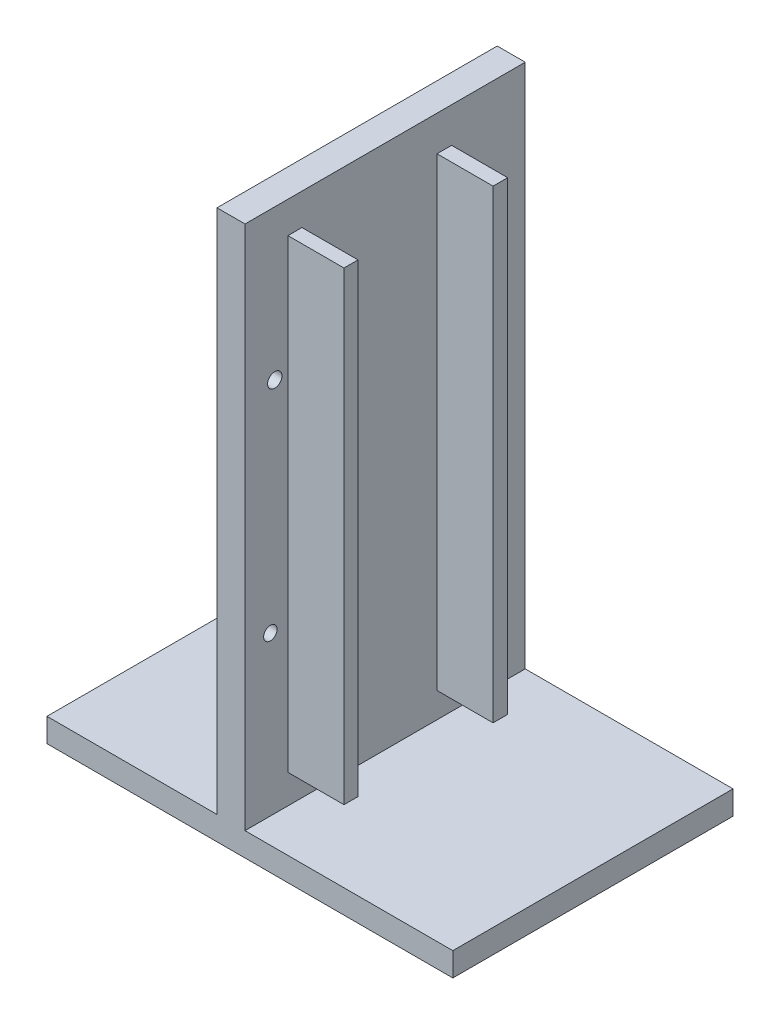
ISO-10303-21;
HEADER;
FILE_DESCRIPTION(('STEP AP214'),'2;1');
FILE_NAME('part.step','',(''),(''),'','','');
FILE_SCHEMA(('AUTOMOTIVE_DESIGN { 1 0 10303 214 1 1 1 1 }'));
ENDSEC;
DATA;
#1=APPLICATION_CONTEXT('core data for automotive mechanical design processes');
#2=APPLICATION_PROTOCOL_DEFINITION('international standard','automotive_design',2000,#1);
#3=PRODUCT_CONTEXT('',#1,'mechanical');
#4=PRODUCT('Part','Part','',(#3));
#5=PRODUCT_RELATED_PRODUCT_CATEGORY('part','',(#4));
#6=PRODUCT_DEFINITION_FORMATION('','',#4);
#7=PRODUCT_DEFINITION_CONTEXT('part definition',#1,'design');
#8=PRODUCT_DEFINITION('design','',#6,#7);
#9=PRODUCT_DEFINITION_SHAPE('','',#8);
#10=(LENGTH_UNIT() NAMED_UNIT(*) SI_UNIT(.MILLI.,.METRE.));
#11=(NAMED_UNIT(*) PLANE_ANGLE_UNIT() SI_UNIT($,.RADIAN.));
#12=(NAMED_UNIT(*) SI_UNIT($,.STERADIAN.) SOLID_ANGLE_UNIT());
#13=UNCERTAINTY_MEASURE_WITH_UNIT(LENGTH_MEASURE(1.E-05),#10,'distance_accuracy_value','');
#14=(GEOMETRIC_REPRESENTATION_CONTEXT(3) GLOBAL_UNCERTAINTY_ASSIGNED_CONTEXT((#13)) GLOBAL_UNIT_ASSIGNED_CONTEXT((#10,
#11,#12)) REPRESENTATION_CONTEXT('',''));
#15=CARTESIAN_POINT('',(0.,0.,0.));
#16=DIRECTION('',(0.,0.,1.));
#17=DIRECTION('',(1.,0.,0.));
#18=AXIS2_PLACEMENT_3D('',#15,#16,#17);
#19=CARTESIAN_POINT('',(35.9064011196088,99.547402553867,0.));
#20=DIRECTION('',(-1.,0.,0.));
#21=DIRECTION('',(0.,-1.,0.));
#22=AXIS2_PLACEMENT_3D('',#19,#20,#21);
#23=PLANE('',#22);
#24=CARTESIAN_POINT('',(35.9064011196088,30.8935257062994,11.3557992246511));
#25=DIRECTION('',(1.,0.,0.));
#26=DIRECTION('',(0.,1.,0.));
#27=AXIS2_PLACEMENT_3D('',#24,#25,#26);
#28=CIRCLE('',#27,1.36409336612033);
#29=CARTESIAN_POINT('',(35.9064011196088,32.2576190724197,11.3557992246511));
#30=VERTEX_POINT('',#29);
#31=EDGE_CURVE('E283',#30,#30,#28,.T.);
#32=ORIENTED_EDGE('',*,*,#31,.F.);
#33=EDGE_LOOP('',(#32));
#34=FACE_BOUND('',#33,.T.);
#35=CARTESIAN_POINT('',(35.9064011196088,33.0134050686162,46.2013162427337));
#36=DIRECTION('',(1.,0.,0.));
#37=DIRECTION('',(0.,1.,0.));
#38=AXIS2_PLACEMENT_3D('',#35,#36,#37);
#39=CIRCLE('',#38,1.22152012656111);
#40=CARTESIAN_POINT('',(35.9064011196088,34.2349251951773,46.2013162427337));
#41=VERTEX_POINT('',#40);
#42=EDGE_CURVE('E273',#41,#41,#39,.T.);
#43=ORIENTED_EDGE('',*,*,#42,.F.);
#44=EDGE_LOOP('',(#43));
#45=FACE_BOUND('',#44,.T.);
#46=CARTESIAN_POINT('',(35.9064011196088,73.1586204924908,10.9583218442167));
#47=DIRECTION('',(1.,0.,0.));
#48=DIRECTION('',(0.,1.,0.));
#49=AXIS2_PLACEMENT_3D('',#46,#47,#48);
#50=CIRCLE('',#49,1.324924601448);
#51=CARTESIAN_POINT('',(35.9064011196088,74.4835450939388,10.9583218442167));
#52=VERTEX_POINT('',#51);
#53=EDGE_CURVE('E270',#52,#52,#50,.T.);
#54=ORIENTED_EDGE('',*,*,#53,.F.);
#55=EDGE_LOOP('',(#54));
#56=FACE_BOUND('',#55,.T.);
#57=CARTESIAN_POINT('',(35.9064011196088,72.363665731622,45.4063614818649));
#58=DIRECTION('',(1.,0.,0.));
#59=DIRECTION('',(0.,1.,0.));
#60=AXIS2_PLACEMENT_3D('',#57,#58,#59);
#61=CIRCLE('',#60,1.30489939977627);
#62=CARTESIAN_POINT('',(35.9064011196088,73.6685651313982,45.4063614818649));
#63=VERTEX_POINT('',#62);
#64=EDGE_CURVE('E267',#63,#63,#61,.T.);
#65=ORIENTED_EDGE('',*,*,#64,.F.);
#66=EDGE_LOOP('',(#65));
#67=FACE_BOUND('',#66,.T.);
#68=DIRECTION('',(0.,-1.,0.));
#69=VECTOR('',#68,1.);
#70=CARTESIAN_POINT('',(35.9064011196088,93.8274442750797,43.0214971992585));
#71=LINE('',#70,#69);
#72=CARTESIAN_POINT('',(35.9064011196088,93.8274442750797,43.0214971992585));
#73=VERTEX_POINT('',#72);
#74=CARTESIAN_POINT('',(35.9064011196088,9.56223962298647,43.0214971992585));
#75=VERTEX_POINT('',#74);
#76=EDGE_CURVE('E169',#73,#75,#71,.T.);
#77=ORIENTED_EDGE('',*,*,#76,.F.);
#78=DIRECTION('',(0.,0.,1.));
#79=VECTOR('',#78,1.);
#80=CARTESIAN_POINT('',(35.9064011196088,93.8274442750797,43.0214971992585));
#81=LINE('',#80,#79);
#82=CARTESIAN_POINT('',(35.9064011196088,93.8274442750797,40.4814971992585));
#83=VERTEX_POINT('',#82);
#84=EDGE_CURVE('E182',#83,#73,#81,.T.);
#85=ORIENTED_EDGE('',*,*,#84,.F.);
#86=DIRECTION('',(0.,1.,0.));
#87=VECTOR('',#86,1.);
#88=CARTESIAN_POINT('',(35.9064011196088,93.8274442750797,40.4814971992585));
#89=LINE('',#88,#87);
#90=CARTESIAN_POINT('',(35.9064011196088,9.56223962298647,40.4814971992585));
#91=VERTEX_POINT('',#90);
#92=EDGE_CURVE('E191',#91,#83,#89,.T.);
#93=ORIENTED_EDGE('',*,*,#92,.F.);
#94=DIRECTION('',(0.,0.,-1.));
#95=VECTOR('',#94,1.);
#96=CARTESIAN_POINT('',(35.9064011196088,9.56223962298646,43.0214971992585));
#97=LINE('',#96,#95);
#98=EDGE_CURVE('E172',#75,#91,#97,.T.);
#99=ORIENTED_EDGE('',*,*,#98,.F.);
#100=EDGE_LOOP('',(#77,#85,#93,#99));
#101=FACE_BOUND('',#100,.T.);
#102=DIRECTION('',(0.,-1.,0.));
#103=VECTOR('',#102,1.);
#104=CARTESIAN_POINT('',(35.9064011196088,99.547402553867,50.8));
#105=LINE('',#104,#103);
#106=CARTESIAN_POINT('',(35.9064011196088,99.547402553867,50.8));
#107=VERTEX_POINT('',#106);
#108=CARTESIAN_POINT('',(35.9064011196088,4.29740255386695,50.8));
#109=VERTEX_POINT('',#108);
#110=EDGE_CURVE('E207',#107,#109,#105,.T.);
#111=ORIENTED_EDGE('',*,*,#110,.T.);
#112=DIRECTION('',(0.,0.,1.));
#113=VECTOR('',#112,1.);
#114=CARTESIAN_POINT('',(35.9064011196088,4.29740255386695,0.));
#115=LINE('',#114,#113);
#116=CARTESIAN_POINT('',(35.9064011196088,4.29740255386695,0.));
#117=VERTEX_POINT('',#116);
#118=EDGE_CURVE('E223',#117,#109,#115,.T.);
#119=ORIENTED_EDGE('',*,*,#118,.F.);
#120=DIRECTION('',(0.,-1.,0.));
#121=VECTOR('',#120,1.);
#122=CARTESIAN_POINT('',(35.9064011196088,99.547402553867,0.));
#123=LINE('',#122,#121);
#124=CARTESIAN_POINT('',(35.9064011196088,99.547402553867,0.));
#125=VERTEX_POINT('',#124);
#126=EDGE_CURVE('E208',#125,#117,#123,.T.);
#127=ORIENTED_EDGE('',*,*,#126,.F.);
#128=DIRECTION('',(0.,0.,1.));
#129=VECTOR('',#128,1.);
#130=CARTESIAN_POINT('',(35.9064011196088,99.547402553867,0.));
#131=LINE('',#130,#129);
#132=EDGE_CURVE('E215',#125,#107,#131,.T.);
#133=ORIENTED_EDGE('',*,*,#132,.T.);
#134=EDGE_LOOP('',(#111,#119,#127,#133));
#135=FACE_BOUND('',#134,.T.);
#136=DIRECTION('',(0.,-1.,0.));
#137=VECTOR('',#136,1.);
#138=CARTESIAN_POINT('',(35.9064011196088,93.1649819743557,15.9930353297192));
#139=LINE('',#138,#137);
#140=CARTESIAN_POINT('',(35.9064011196088,93.1649819743557,15.9930353297192));
#141=VERTEX_POINT('',#140);
#142=CARTESIAN_POINT('',(35.9064011196088,8.89977732226246,15.9930353297192));
#143=VERTEX_POINT('',#142);
#144=EDGE_CURVE('E168',#141,#143,#139,.T.);
#145=ORIENTED_EDGE('',*,*,#144,.F.);
#146=DIRECTION('',(0.,0.,1.));
#147=VECTOR('',#146,1.);
#148=CARTESIAN_POINT('',(35.9064011196088,93.1649819743557,15.9930353297192));
#149=LINE('',#148,#147);
#150=CARTESIAN_POINT('',(35.9064011196088,93.1649819743557,13.3431861268231));
#151=VERTEX_POINT('',#150);
#152=EDGE_CURVE('E165',#151,#141,#149,.T.);
#153=ORIENTED_EDGE('',*,*,#152,.F.);
#154=DIRECTION('',(0.,1.,0.));
#155=VECTOR('',#154,1.);
#156=CARTESIAN_POINT('',(35.9064011196088,93.1649819743557,13.3431861268231));
#157=LINE('',#156,#155);
#158=CARTESIAN_POINT('',(35.9064011196088,8.89977732226246,13.3431861268231));
#159=VERTEX_POINT('',#158);
#160=EDGE_CURVE('E55',#159,#151,#157,.T.);
#161=ORIENTED_EDGE('',*,*,#160,.F.);
#162=DIRECTION('',(0.,0.,-1.));
#163=VECTOR('',#162,1.);
#164=CARTESIAN_POINT('',(35.9064011196088,8.89977732226246,15.9930353297192));
#165=LINE('',#164,#163);
#166=EDGE_CURVE('E50',#143,#159,#165,.T.);
#167=ORIENTED_EDGE('',*,*,#166,.F.);
#168=EDGE_LOOP('',(#145,#153,#161,#167));
#169=FACE_BOUND('',#168,.T.);
#170=ADVANCED_FACE('F33',(#34,#45,#56,#67,#101,#135,#169),#23,.F.);
#171=CARTESIAN_POINT('',(0.,0.,50.8));
#172=DIRECTION('',(1.,0.,0.));
#173=DIRECTION('',(0.,0.,-1.));
#174=AXIS2_PLACEMENT_3D('',#171,#172,#173);
#175=PLANE('',#174);
#176=DIRECTION('',(0.,-1.,0.));
#177=VECTOR('',#176,1.);
#178=CARTESIAN_POINT('',(0.,0.,50.8));
#179=LINE('',#178,#177);
#180=CARTESIAN_POINT('',(0.,4.29740255386696,50.8));
#181=VERTEX_POINT('',#180);
#182=CARTESIAN_POINT('',(0.,0.,50.8));
#183=VERTEX_POINT('',#182);
#184=EDGE_CURVE('E245',#181,#183,#179,.T.);
#185=ORIENTED_EDGE('',*,*,#184,.F.);
#186=DIRECTION('',(0.,0.,1.));
#187=VECTOR('',#186,1.);
#188=CARTESIAN_POINT('',(0.,4.29740255386696,0.));
#189=LINE('',#188,#187);
#190=CARTESIAN_POINT('',(0.,4.29740255386696,0.));
#191=VERTEX_POINT('',#190);
#192=EDGE_CURVE('E233',#191,#181,#189,.T.);
#193=ORIENTED_EDGE('',*,*,#192,.F.);
#194=DIRECTION('',(0.,-1.,0.));
#195=VECTOR('',#194,1.);
#196=CARTESIAN_POINT('',(0.,0.,0.));
#197=LINE('',#196,#195);
#198=CARTESIAN_POINT('',(0.,0.,0.));
#199=VERTEX_POINT('',#198);
#200=EDGE_CURVE('E241',#191,#199,#197,.T.);
#201=ORIENTED_EDGE('',*,*,#200,.T.);
#202=DIRECTION('',(0.,0.,-1.));
#203=VECTOR('',#202,1.);
#204=CARTESIAN_POINT('',(0.,0.,50.8));
#205=LINE('',#204,#203);
#206=EDGE_CURVE('E11',#183,#199,#205,.T.);
#207=ORIENTED_EDGE('',*,*,#206,.F.);
#208=EDGE_LOOP('',(#185,#193,#201,#207));
#209=FACE_BOUND('',#208,.T.);
#210=ADVANCED_FACE('F35',(#209),#175,.F.);
#211=CARTESIAN_POINT('',(0.,0.,50.8));
#212=DIRECTION('',(0.,1.,0.));
#213=DIRECTION('',(0.,0.,1.));
#214=AXIS2_PLACEMENT_3D('',#211,#212,#213);
#215=PLANE('',#214);
#216=DIRECTION('',(1.,0.,0.));
#217=VECTOR('',#216,1.);
#218=CARTESIAN_POINT('',(0.,0.,0.));
#219=LINE('',#218,#217);
#220=CARTESIAN_POINT('',(73.5771236522496,0.,0.));
#221=VERTEX_POINT('',#220);
#222=EDGE_CURVE('E256',#199,#221,#219,.T.);
#223=ORIENTED_EDGE('',*,*,#222,.T.);
#224=DIRECTION('',(0.,0.,-1.));
#225=VECTOR('',#224,1.);
#226=CARTESIAN_POINT('',(73.5771236522496,0.,50.8));
#227=LINE('',#226,#225);
#228=CARTESIAN_POINT('',(73.5771236522496,0.,50.8));
#229=VERTEX_POINT('',#228);
#230=EDGE_CURVE('E42',#229,#221,#227,.T.);
#231=ORIENTED_EDGE('',*,*,#230,.F.);
#232=DIRECTION('',(1.,0.,0.));
#233=VECTOR('',#232,1.);
#234=CARTESIAN_POINT('',(0.,0.,50.8));
#235=LINE('',#234,#233);
#236=EDGE_CURVE('E247',#183,#229,#235,.T.);
#237=ORIENTED_EDGE('',*,*,#236,.F.);
#238=ORIENTED_EDGE('',*,*,#206,.T.);
#239=EDGE_LOOP('',(#223,#231,#237,#238));
#240=FACE_BOUND('',#239,.T.);
#241=ADVANCED_FACE('F316',(#240),#215,.F.);
#242=CARTESIAN_POINT('',(73.5771236522496,0.,50.8));
#243=DIRECTION('',(-1.,0.,0.));
#244=DIRECTION('',(0.,0.,1.));
#245=AXIS2_PLACEMENT_3D('',#242,#243,#244);
#246=PLANE('',#245);
#247=DIRECTION('',(0.,1.,0.));
#248=VECTOR('',#247,1.);
#249=CARTESIAN_POINT('',(73.5771236522496,0.,0.));
#250=LINE('',#249,#248);
#251=CARTESIAN_POINT('',(73.5771236522496,4.29740255386696,0.));
#252=VERTEX_POINT('',#251);
#253=EDGE_CURVE('E258',#221,#252,#250,.T.);
#254=ORIENTED_EDGE('',*,*,#253,.T.);
#255=DIRECTION('',(0.,0.,1.));
#256=VECTOR('',#255,1.);
#257=CARTESIAN_POINT('',(73.5771236522496,4.29740255386696,0.));
#258=LINE('',#257,#256);
#259=CARTESIAN_POINT('',(73.5771236522496,4.29740255386696,50.8));
#260=VERTEX_POINT('',#259);
#261=EDGE_CURVE('E219',#252,#260,#258,.T.);
#262=ORIENTED_EDGE('',*,*,#261,.T.);
#263=DIRECTION('',(0.,1.,0.));
#264=VECTOR('',#263,1.);
#265=CARTESIAN_POINT('',(73.5771236522496,0.,50.8));
#266=LINE('',#265,#264);
#267=EDGE_CURVE('E250',#229,#260,#266,.T.);
#268=ORIENTED_EDGE('',*,*,#267,.F.);
#269=ORIENTED_EDGE('',*,*,#230,.T.);
#270=EDGE_LOOP('',(#254,#262,#268,#269));
#271=FACE_BOUND('',#270,.T.);
#272=ADVANCED_FACE('F343',(#271),#246,.F.);
#273=CARTESIAN_POINT('',(0.,99.547402553867,50.8));
#274=DIRECTION('',(0.,-1.,0.));
#275=DIRECTION('',(0.,0.,-1.));
#276=AXIS2_PLACEMENT_3D('',#273,#274,#275);
#277=PLANE('',#276);
#278=DIRECTION('',(-1.,0.,0.));
#279=VECTOR('',#278,1.);
#280=CARTESIAN_POINT('',(0.,99.547402553867,50.8));
#281=LINE('',#280,#279);
#282=CARTESIAN_POINT('',(30.8264011196088,99.547402553867,50.8));
#283=VERTEX_POINT('',#282);
#284=EDGE_CURVE('E253',#107,#283,#281,.T.);
#285=ORIENTED_EDGE('',*,*,#284,.F.);
#286=ORIENTED_EDGE('',*,*,#132,.F.);
#287=DIRECTION('',(-1.,0.,0.));
#288=VECTOR('',#287,1.);
#289=CARTESIAN_POINT('',(0.,99.547402553867,0.));
#290=LINE('',#289,#288);
#291=CARTESIAN_POINT('',(30.8264011196088,99.547402553867,0.));
#292=VERTEX_POINT('',#291);
#293=EDGE_CURVE('E248',#125,#292,#290,.T.);
#294=ORIENTED_EDGE('',*,*,#293,.T.);
#295=DIRECTION('',(0.,0.,1.));
#296=VECTOR('',#295,1.);
#297=CARTESIAN_POINT('',(30.8264011196088,99.547402553867,0.));
#298=LINE('',#297,#296);
#299=EDGE_CURVE('E238',#292,#283,#298,.T.);
#300=ORIENTED_EDGE('',*,*,#299,.T.);
#301=EDGE_LOOP('',(#285,#286,#294,#300));
#302=FACE_BOUND('',#301,.T.);
#303=ADVANCED_FACE('F336',(#302),#277,.F.);
#304=CARTESIAN_POINT('',(0.,0.,50.8));
#305=DIRECTION('',(0.,0.,-1.));
#306=DIRECTION('',(-1.,0.,0.));
#307=AXIS2_PLACEMENT_3D('',#304,#305,#306);
#308=PLANE('',#307);
#309=ORIENTED_EDGE('',*,*,#267,.T.);
#310=DIRECTION('',(1.,0.,0.));
#311=VECTOR('',#310,1.);
#312=CARTESIAN_POINT('',(73.5771236522496,4.29740255386696,50.8));
#313=LINE('',#312,#311);
#314=EDGE_CURVE('E212',#109,#260,#313,.T.);
#315=ORIENTED_EDGE('',*,*,#314,.F.);
#316=ORIENTED_EDGE('',*,*,#110,.F.);
#317=ORIENTED_EDGE('',*,*,#284,.T.);
#318=DIRECTION('',(0.,1.,0.));
#319=VECTOR('',#318,1.);
#320=CARTESIAN_POINT('',(30.8264011196088,99.547402553867,50.8));
#321=LINE('',#320,#319);
#322=CARTESIAN_POINT('',(30.8264011196088,4.29740255386696,50.8));
#323=VERTEX_POINT('',#322);
#324=EDGE_CURVE('E230',#323,#283,#321,.T.);
#325=ORIENTED_EDGE('',*,*,#324,.F.);
#326=DIRECTION('',(1.,0.,0.));
#327=VECTOR('',#326,1.);
#328=CARTESIAN_POINT('',(0.,4.29740255386696,50.8));
#329=LINE('',#328,#327);
#330=EDGE_CURVE('E222',#181,#323,#329,.T.);
#331=ORIENTED_EDGE('',*,*,#330,.F.);
#332=ORIENTED_EDGE('',*,*,#184,.T.);
#333=ORIENTED_EDGE('',*,*,#236,.T.);
#334=EDGE_LOOP('',(#309,#315,#316,#317,#325,#331,#332,#333));
#335=FACE_BOUND('',#334,.T.);
#336=ADVANCED_FACE('F333',(#335),#308,.F.);
#337=CARTESIAN_POINT('',(0.,0.,0.));
#338=DIRECTION('',(0.,0.,-1.));
#339=DIRECTION('',(-1.,0.,0.));
#340=AXIS2_PLACEMENT_3D('',#337,#338,#339);
#341=PLANE('',#340);
#342=DIRECTION('',(1.,0.,0.));
#343=VECTOR('',#342,1.);
#344=CARTESIAN_POINT('',(73.5771236522496,4.29740255386696,0.));
#345=LINE('',#344,#343);
#346=EDGE_CURVE('E211',#117,#252,#345,.T.);
#347=ORIENTED_EDGE('',*,*,#346,.T.);
#348=ORIENTED_EDGE('',*,*,#253,.F.);
#349=ORIENTED_EDGE('',*,*,#222,.F.);
#350=ORIENTED_EDGE('',*,*,#200,.F.);
#351=DIRECTION('',(1.,0.,0.));
#352=VECTOR('',#351,1.);
#353=CARTESIAN_POINT('',(0.,4.29740255386696,0.));
#354=LINE('',#353,#352);
#355=CARTESIAN_POINT('',(30.8264011196088,4.29740255386696,0.));
#356=VERTEX_POINT('',#355);
#357=EDGE_CURVE('E226',#191,#356,#354,.T.);
#358=ORIENTED_EDGE('',*,*,#357,.T.);
#359=DIRECTION('',(0.,1.,0.));
#360=VECTOR('',#359,1.);
#361=CARTESIAN_POINT('',(30.8264011196088,99.547402553867,0.));
#362=LINE('',#361,#360);
#363=EDGE_CURVE('E229',#356,#292,#362,.T.);
#364=ORIENTED_EDGE('',*,*,#363,.T.);
#365=ORIENTED_EDGE('',*,*,#293,.F.);
#366=ORIENTED_EDGE('',*,*,#126,.T.);
#367=EDGE_LOOP('',(#347,#348,#349,#350,#358,#364,#365,#366));
#368=FACE_BOUND('',#367,.T.);
#369=ADVANCED_FACE('F328',(#368),#341,.T.);
#370=CARTESIAN_POINT('',(30.8264011196088,99.547402553867,0.));
#371=DIRECTION('',(1.,0.,0.));
#372=DIRECTION('',(0.,1.,0.));
#373=AXIS2_PLACEMENT_3D('',#370,#371,#372);
#374=PLANE('',#373);
#375=CARTESIAN_POINT('',(30.8264011196088,30.8935257062994,11.3557992246511));
#376=DIRECTION('',(1.,0.,0.));
#377=DIRECTION('',(0.,1.,0.));
#378=AXIS2_PLACEMENT_3D('',#375,#376,#377);
#379=CIRCLE('',#378,1.36409336612033);
#380=CARTESIAN_POINT('',(30.8264011196088,32.2576190724197,11.3557992246511));
#381=VERTEX_POINT('',#380);
#382=EDGE_CURVE('E37',#381,#381,#379,.T.);
#383=ORIENTED_EDGE('',*,*,#382,.T.);
#384=EDGE_LOOP('',(#383));
#385=FACE_BOUND('',#384,.T.);
#386=CARTESIAN_POINT('',(30.8264011196088,33.0134050686162,46.2013162427337));
#387=DIRECTION('',(1.,0.,0.));
#388=DIRECTION('',(0.,1.,0.));
#389=AXIS2_PLACEMENT_3D('',#386,#387,#388);
#390=CIRCLE('',#389,1.22152012656111);
#391=CARTESIAN_POINT('',(30.8264011196088,34.2349251951773,46.2013162427337));
#392=VERTEX_POINT('',#391);
#393=EDGE_CURVE('E271',#392,#392,#390,.T.);
#394=ORIENTED_EDGE('',*,*,#393,.T.);
#395=EDGE_LOOP('',(#394));
#396=FACE_BOUND('',#395,.T.);
#397=CARTESIAN_POINT('',(30.8264011196088,73.1586204924908,10.9583218442167));
#398=DIRECTION('',(1.,0.,0.));
#399=DIRECTION('',(0.,1.,0.));
#400=AXIS2_PLACEMENT_3D('',#397,#398,#399);
#401=CIRCLE('',#400,1.324924601448);
#402=CARTESIAN_POINT('',(30.8264011196088,74.4835450939388,10.9583218442167));
#403=VERTEX_POINT('',#402);
#404=EDGE_CURVE('E268',#403,#403,#401,.T.);
#405=ORIENTED_EDGE('',*,*,#404,.T.);
#406=EDGE_LOOP('',(#405));
#407=FACE_BOUND('',#406,.T.);
#408=CARTESIAN_POINT('',(30.8264011196088,72.363665731622,45.4063614818649));
#409=DIRECTION('',(1.,0.,0.));
#410=DIRECTION('',(0.,1.,0.));
#411=AXIS2_PLACEMENT_3D('',#408,#409,#410);
#412=CIRCLE('',#411,1.30489939977627);
#413=CARTESIAN_POINT('',(30.8264011196088,73.6685651313982,45.4063614818649));
#414=VERTEX_POINT('',#413);
#415=EDGE_CURVE('E264',#414,#414,#412,.T.);
#416=ORIENTED_EDGE('',*,*,#415,.T.);
#417=EDGE_LOOP('',(#416));
#418=FACE_BOUND('',#417,.T.);
#419=ORIENTED_EDGE('',*,*,#324,.T.);
#420=ORIENTED_EDGE('',*,*,#299,.F.);
#421=ORIENTED_EDGE('',*,*,#363,.F.);
#422=DIRECTION('',(0.,0.,1.));
#423=VECTOR('',#422,1.);
#424=CARTESIAN_POINT('',(30.8264011196088,4.29740255386696,0.));
#425=LINE('',#424,#423);
#426=EDGE_CURVE('E242',#356,#323,#425,.T.);
#427=ORIENTED_EDGE('',*,*,#426,.T.);
#428=EDGE_LOOP('',(#419,#420,#421,#427));
#429=FACE_BOUND('',#428,.T.);
#430=ADVANCED_FACE('F324',(#385,#396,#407,#418,#429),#374,.F.);
#431=CARTESIAN_POINT('',(0.,4.29740255386696,0.));
#432=DIRECTION('',(0.,-1.,0.));
#433=DIRECTION('',(0.,0.,-1.));
#434=AXIS2_PLACEMENT_3D('',#431,#432,#433);
#435=PLANE('',#434);
#436=ORIENTED_EDGE('',*,*,#330,.T.);
#437=ORIENTED_EDGE('',*,*,#426,.F.);
#438=ORIENTED_EDGE('',*,*,#357,.F.);
#439=ORIENTED_EDGE('',*,*,#192,.T.);
#440=EDGE_LOOP('',(#436,#437,#438,#439));
#441=FACE_BOUND('',#440,.T.);
#442=ADVANCED_FACE('F327',(#441),#435,.F.);
#443=CARTESIAN_POINT('',(73.5771236522496,4.29740255386696,0.));
#444=DIRECTION('',(0.,-1.,0.));
#445=DIRECTION('',(1.,0.,0.));
#446=AXIS2_PLACEMENT_3D('',#443,#444,#445);
#447=PLANE('',#446);
#448=ORIENTED_EDGE('',*,*,#314,.T.);
#449=ORIENTED_EDGE('',*,*,#261,.F.);
#450=ORIENTED_EDGE('',*,*,#346,.F.);
#451=ORIENTED_EDGE('',*,*,#118,.T.);
#452=EDGE_LOOP('',(#448,#449,#450,#451));
#453=FACE_BOUND('',#452,.T.);
#454=ADVANCED_FACE('F322',(#453),#447,.F.);
#455=CARTESIAN_POINT('',(46.0664011196088,93.8274442750797,43.0214971992585));
#456=DIRECTION('',(0.,0.,-1.));
#457=DIRECTION('',(-1.,0.,0.));
#458=AXIS2_PLACEMENT_3D('',#455,#456,#457);
#459=PLANE('',#458);
#460=ORIENTED_EDGE('',*,*,#76,.T.);
#461=DIRECTION('',(-1.,0.,0.));
#462=VECTOR('',#461,1.);
#463=CARTESIAN_POINT('',(46.0664011196088,9.56223962298646,43.0214971992585));
#464=LINE('',#463,#462);
#465=CARTESIAN_POINT('',(46.0664011196088,9.56223962298646,43.0214971992585));
#466=VERTEX_POINT('',#465);
#467=EDGE_CURVE('E204',#466,#75,#464,.T.);
#468=ORIENTED_EDGE('',*,*,#467,.F.);
#469=DIRECTION('',(0.,-1.,0.));
#470=VECTOR('',#469,1.);
#471=CARTESIAN_POINT('',(46.0664011196088,93.8274442750797,43.0214971992585));
#472=LINE('',#471,#470);
#473=CARTESIAN_POINT('',(46.0664011196088,93.8274442750797,43.0214971992585));
#474=VERTEX_POINT('',#473);
#475=EDGE_CURVE('E178',#474,#466,#472,.T.);
#476=ORIENTED_EDGE('',*,*,#475,.F.);
#477=DIRECTION('',(-1.,0.,0.));
#478=VECTOR('',#477,1.);
#479=CARTESIAN_POINT('',(46.0664011196088,93.8274442750797,43.0214971992585));
#480=LINE('',#479,#478);
#481=EDGE_CURVE('E187',#474,#73,#480,.T.);
#482=ORIENTED_EDGE('',*,*,#481,.T.);
#483=EDGE_LOOP('',(#460,#468,#476,#482));
#484=FACE_BOUND('',#483,.T.);
#485=ADVANCED_FACE('F374',(#484),#459,.F.);
#486=CARTESIAN_POINT('',(46.0664011196088,9.56223962298646,43.0214971992585));
#487=DIRECTION('',(0.,1.,0.));
#488=DIRECTION('',(-1.,0.,0.));
#489=AXIS2_PLACEMENT_3D('',#486,#487,#488);
#490=PLANE('',#489);
#491=ORIENTED_EDGE('',*,*,#98,.T.);
#492=DIRECTION('',(-1.,0.,0.));
#493=VECTOR('',#492,1.);
#494=CARTESIAN_POINT('',(46.0664011196088,9.56223962298646,40.4814971992585));
#495=LINE('',#494,#493);
#496=CARTESIAN_POINT('',(46.0664011196088,9.56223962298646,40.4814971992585));
#497=VERTEX_POINT('',#496);
#498=EDGE_CURVE('E201',#497,#91,#495,.T.);
#499=ORIENTED_EDGE('',*,*,#498,.F.);
#500=DIRECTION('',(0.,0.,-1.));
#501=VECTOR('',#500,1.);
#502=CARTESIAN_POINT('',(46.0664011196088,9.56223962298646,43.0214971992585));
#503=LINE('',#502,#501);
#504=EDGE_CURVE('E181',#466,#497,#503,.T.);
#505=ORIENTED_EDGE('',*,*,#504,.F.);
#506=ORIENTED_EDGE('',*,*,#467,.T.);
#507=EDGE_LOOP('',(#491,#499,#505,#506));
#508=FACE_BOUND('',#507,.T.);
#509=ADVANCED_FACE('F378',(#508),#490,.F.);
#510=CARTESIAN_POINT('',(46.0664011196088,93.8274442750797,40.4814971992585));
#511=DIRECTION('',(0.,0.,1.));
#512=DIRECTION('',(0.,-1.,0.));
#513=AXIS2_PLACEMENT_3D('',#510,#511,#512);
#514=PLANE('',#513);
#515=ORIENTED_EDGE('',*,*,#92,.T.);
#516=DIRECTION('',(-1.,0.,0.));
#517=VECTOR('',#516,1.);
#518=CARTESIAN_POINT('',(46.0664011196088,93.8274442750797,40.4814971992585));
#519=LINE('',#518,#517);
#520=CARTESIAN_POINT('',(46.0664011196088,93.8274442750797,40.4814971992585));
#521=VERTEX_POINT('',#520);
#522=EDGE_CURVE('E198',#521,#83,#519,.T.);
#523=ORIENTED_EDGE('',*,*,#522,.F.);
#524=DIRECTION('',(0.,1.,0.));
#525=VECTOR('',#524,1.);
#526=CARTESIAN_POINT('',(46.0664011196088,93.8274442750797,40.4814971992585));
#527=LINE('',#526,#525);
#528=EDGE_CURVE('E184',#497,#521,#527,.T.);
#529=ORIENTED_EDGE('',*,*,#528,.F.);
#530=ORIENTED_EDGE('',*,*,#498,.T.);
#531=EDGE_LOOP('',(#515,#523,#529,#530));
#532=FACE_BOUND('',#531,.T.);
#533=ADVANCED_FACE('F383',(#532),#514,.F.);
#534=CARTESIAN_POINT('',(46.0664011196088,93.8274442750797,43.0214971992585));
#535=DIRECTION('',(0.,-1.,0.));
#536=DIRECTION('',(1.,0.,0.));
#537=AXIS2_PLACEMENT_3D('',#534,#535,#536);
#538=PLANE('',#537);
#539=ORIENTED_EDGE('',*,*,#84,.T.);
#540=ORIENTED_EDGE('',*,*,#481,.F.);
#541=DIRECTION('',(0.,0.,1.));
#542=VECTOR('',#541,1.);
#543=CARTESIAN_POINT('',(46.0664011196088,93.8274442750797,43.0214971992585));
#544=LINE('',#543,#542);
#545=EDGE_CURVE('E186',#521,#474,#544,.T.);
#546=ORIENTED_EDGE('',*,*,#545,.F.);
#547=ORIENTED_EDGE('',*,*,#522,.T.);
#548=EDGE_LOOP('',(#539,#540,#546,#547));
#549=FACE_BOUND('',#548,.T.);
#550=ADVANCED_FACE('F389',(#549),#538,.F.);
#551=CARTESIAN_POINT('',(46.0664011196088,0.,0.));
#552=DIRECTION('',(1.,0.,0.));
#553=DIRECTION('',(0.,1.,0.));
#554=AXIS2_PLACEMENT_3D('',#551,#552,#553);
#555=PLANE('',#554);
#556=ORIENTED_EDGE('',*,*,#475,.T.);
#557=ORIENTED_EDGE('',*,*,#504,.T.);
#558=ORIENTED_EDGE('',*,*,#528,.T.);
#559=ORIENTED_EDGE('',*,*,#545,.T.);
#560=EDGE_LOOP('',(#556,#557,#558,#559));
#561=FACE_BOUND('',#560,.T.);
#562=ADVANCED_FACE('F393',(#561),#555,.T.);
#563=CARTESIAN_POINT('',(46.0664011196088,93.1649819743557,15.9930353297192));
#564=DIRECTION('',(0.,0.,-1.));
#565=DIRECTION('',(-1.,0.,0.));
#566=AXIS2_PLACEMENT_3D('',#563,#564,#565);
#567=PLANE('',#566);
#568=ORIENTED_EDGE('',*,*,#144,.T.);
#569=DIRECTION('',(-1.,0.,0.));
#570=VECTOR('',#569,1.);
#571=CARTESIAN_POINT('',(46.0664011196088,8.89977732226246,15.9930353297192));
#572=LINE('',#571,#570);
#573=CARTESIAN_POINT('',(46.0664011196088,8.89977732226246,15.9930353297192));
#574=VERTEX_POINT('',#573);
#575=EDGE_CURVE('E149',#574,#143,#572,.T.);
#576=ORIENTED_EDGE('',*,*,#575,.F.);
#577=DIRECTION('',(0.,-1.,0.));
#578=VECTOR('',#577,1.);
#579=CARTESIAN_POINT('',(46.0664011196088,93.1649819743557,15.9930353297192));
#580=LINE('',#579,#578);
#581=CARTESIAN_POINT('',(46.0664011196088,93.1649819743557,15.9930353297192));
#582=VERTEX_POINT('',#581);
#583=EDGE_CURVE('E156',#582,#574,#580,.T.);
#584=ORIENTED_EDGE('',*,*,#583,.F.);
#585=DIRECTION('',(-1.,0.,0.));
#586=VECTOR('',#585,1.);
#587=CARTESIAN_POINT('',(46.0664011196088,93.1649819743557,15.9930353297192));
#588=LINE('',#587,#586);
#589=EDGE_CURVE('E290',#582,#141,#588,.T.);
#590=ORIENTED_EDGE('',*,*,#589,.T.);
#591=EDGE_LOOP('',(#568,#576,#584,#590));
#592=FACE_BOUND('',#591,.T.);
#593=ADVANCED_FACE('F167',(#592),#567,.F.);
#594=CARTESIAN_POINT('',(46.0664011196088,8.89977732226246,15.9930353297192));
#595=DIRECTION('',(0.,1.,0.));
#596=DIRECTION('',(-1.,0.,0.));
#597=AXIS2_PLACEMENT_3D('',#594,#595,#596);
#598=PLANE('',#597);
#599=ORIENTED_EDGE('',*,*,#166,.T.);
#600=DIRECTION('',(-1.,0.,0.));
#601=VECTOR('',#600,1.);
#602=CARTESIAN_POINT('',(46.0664011196088,8.89977732226246,13.3431861268231));
#603=LINE('',#602,#601);
#604=CARTESIAN_POINT('',(46.0664011196088,8.89977732226246,13.3431861268231));
#605=VERTEX_POINT('',#604);
#606=EDGE_CURVE('E152',#605,#159,#603,.T.);
#607=ORIENTED_EDGE('',*,*,#606,.F.);
#608=DIRECTION('',(0.,0.,-1.));
#609=VECTOR('',#608,1.);
#610=CARTESIAN_POINT('',(46.0664011196088,8.89977732226246,15.9930353297192));
#611=LINE('',#610,#609);
#612=EDGE_CURVE('E145',#574,#605,#611,.T.);
#613=ORIENTED_EDGE('',*,*,#612,.F.);
#614=ORIENTED_EDGE('',*,*,#575,.T.);
#615=EDGE_LOOP('',(#599,#607,#613,#614));
#616=FACE_BOUND('',#615,.T.);
#617=ADVANCED_FACE('F147',(#616),#598,.F.);
#618=CARTESIAN_POINT('',(46.0664011196088,93.1649819743557,13.3431861268231));
#619=DIRECTION('',(0.,0.,1.));
#620=DIRECTION('',(1.,0.,0.));
#621=AXIS2_PLACEMENT_3D('',#618,#619,#620);
#622=PLANE('',#621);
#623=ORIENTED_EDGE('',*,*,#160,.T.);
#624=DIRECTION('',(-1.,0.,0.));
#625=VECTOR('',#624,1.);
#626=CARTESIAN_POINT('',(46.0664011196088,93.1649819743557,13.3431861268231));
#627=LINE('',#626,#625);
#628=CARTESIAN_POINT('',(46.0664011196088,93.1649819743557,13.3431861268231));
#629=VERTEX_POINT('',#628);
#630=EDGE_CURVE('E174',#629,#151,#627,.T.);
#631=ORIENTED_EDGE('',*,*,#630,.F.);
#632=DIRECTION('',(0.,1.,0.));
#633=VECTOR('',#632,1.);
#634=CARTESIAN_POINT('',(46.0664011196088,93.1649819743557,13.3431861268231));
#635=LINE('',#634,#633);
#636=EDGE_CURVE('E155',#605,#629,#635,.T.);
#637=ORIENTED_EDGE('',*,*,#636,.F.);
#638=ORIENTED_EDGE('',*,*,#606,.T.);
#639=EDGE_LOOP('',(#623,#631,#637,#638));
#640=FACE_BOUND('',#639,.T.);
#641=ADVANCED_FACE('F301',(#640),#622,.F.);
#642=CARTESIAN_POINT('',(46.0664011196088,93.1649819743557,15.9930353297192));
#643=DIRECTION('',(0.,-1.,0.));
#644=DIRECTION('',(1.,0.,0.));
#645=AXIS2_PLACEMENT_3D('',#642,#643,#644);
#646=PLANE('',#645);
#647=ORIENTED_EDGE('',*,*,#152,.T.);
#648=ORIENTED_EDGE('',*,*,#589,.F.);
#649=DIRECTION('',(0.,0.,1.));
#650=VECTOR('',#649,1.);
#651=CARTESIAN_POINT('',(46.0664011196088,93.1649819743557,15.9930353297192));
#652=LINE('',#651,#650);
#653=EDGE_CURVE('E161',#629,#582,#652,.T.);
#654=ORIENTED_EDGE('',*,*,#653,.F.);
#655=ORIENTED_EDGE('',*,*,#630,.T.);
#656=EDGE_LOOP('',(#647,#648,#654,#655));
#657=FACE_BOUND('',#656,.T.);
#658=ADVANCED_FACE('F299',(#657),#646,.F.);
#659=CARTESIAN_POINT('',(46.0664011196088,0.,0.));
#660=DIRECTION('',(1.,0.,0.));
#661=DIRECTION('',(0.,1.,0.));
#662=AXIS2_PLACEMENT_3D('',#659,#660,#661);
#663=PLANE('',#662);
#664=ORIENTED_EDGE('',*,*,#583,.T.);
#665=ORIENTED_EDGE('',*,*,#612,.T.);
#666=ORIENTED_EDGE('',*,*,#636,.T.);
#667=ORIENTED_EDGE('',*,*,#653,.T.);
#668=EDGE_LOOP('',(#664,#665,#666,#667));
#669=FACE_BOUND('',#668,.T.);
#670=ADVANCED_FACE('F159',(#669),#663,.T.);
#671=CARTESIAN_POINT('',(25.7464011196088,72.363665731622,45.4063614818649));
#672=DIRECTION('',(1.,0.,0.));
#673=DIRECTION('',(0.,1.,0.));
#674=AXIS2_PLACEMENT_3D('',#671,#672,#673);
#675=CYLINDRICAL_SURFACE('',#674,1.30489939977627);
#676=ORIENTED_EDGE('',*,*,#64,.T.);
#677=EDGE_LOOP('',(#676));
#678=FACE_BOUND('',#677,.T.);
#679=ORIENTED_EDGE('',*,*,#415,.F.);
#680=EDGE_LOOP('',(#679));
#681=FACE_BOUND('',#680,.T.);
#682=ADVANCED_FACE('F426',(#678,#681),#675,.F.);
#683=CARTESIAN_POINT('',(25.7464011196088,73.1586204924908,10.9583218442167));
#684=DIRECTION('',(1.,0.,0.));
#685=DIRECTION('',(0.,1.,0.));
#686=AXIS2_PLACEMENT_3D('',#683,#684,#685);
#687=CYLINDRICAL_SURFACE('',#686,1.324924601448);
#688=ORIENTED_EDGE('',*,*,#53,.T.);
#689=EDGE_LOOP('',(#688));
#690=FACE_BOUND('',#689,.T.);
#691=ORIENTED_EDGE('',*,*,#404,.F.);
#692=EDGE_LOOP('',(#691));
#693=FACE_BOUND('',#692,.T.);
#694=ADVANCED_FACE('F435',(#690,#693),#687,.F.);
#695=CARTESIAN_POINT('',(25.7464011196088,33.0134050686162,46.2013162427337));
#696=DIRECTION('',(1.,0.,0.));
#697=DIRECTION('',(0.,1.,0.));
#698=AXIS2_PLACEMENT_3D('',#695,#696,#697);
#699=CYLINDRICAL_SURFACE('',#698,1.22152012656111);
#700=ORIENTED_EDGE('',*,*,#42,.T.);
#701=EDGE_LOOP('',(#700));
#702=FACE_BOUND('',#701,.T.);
#703=ORIENTED_EDGE('',*,*,#393,.F.);
#704=EDGE_LOOP('',(#703));
#705=FACE_BOUND('',#704,.T.);
#706=ADVANCED_FACE('F445',(#702,#705),#699,.F.);
#707=CARTESIAN_POINT('',(25.7464011196088,30.8935257062994,11.3557992246511));
#708=DIRECTION('',(1.,0.,0.));
#709=DIRECTION('',(0.,1.,0.));
#710=AXIS2_PLACEMENT_3D('',#707,#708,#709);
#711=CYLINDRICAL_SURFACE('',#710,1.36409336612033);
#712=ORIENTED_EDGE('',*,*,#31,.T.);
#713=EDGE_LOOP('',(#712));
#714=FACE_BOUND('',#713,.T.);
#715=ORIENTED_EDGE('',*,*,#382,.F.);
#716=EDGE_LOOP('',(#715));
#717=FACE_BOUND('',#716,.T.);
#718=ADVANCED_FACE('F454',(#714,#717),#711,.F.);
#719=CLOSED_SHELL('',(#170,#210,#241,#272,#303,#336,#369,#430,#442,#454,#485,#509,#533,#550,
#562,#593,#617,#641,#658,#670,#682,#694,#706,#718));
#720=MANIFOLD_SOLID_BREP('B2',#719);
#721=ADVANCED_BREP_SHAPE_REPRESENTATION('',(#18,#720),#14);
#722=SHAPE_DEFINITION_REPRESENTATION(#9,#721);
ENDSEC;
END-ISO-10303-21;
